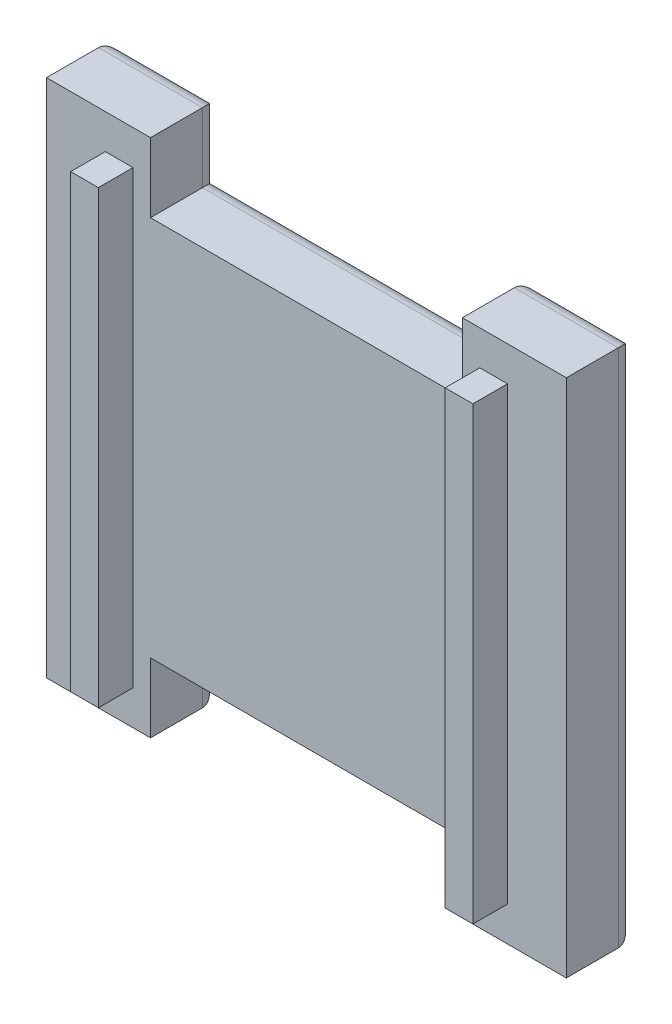
ISO-10303-21;
HEADER;
FILE_DESCRIPTION(('STEP AP214'),'2;1');
FILE_NAME('part.step','',(''),(''),'','','');
FILE_SCHEMA(('AUTOMOTIVE_DESIGN { 1 0 10303 214 1 1 1 1 }'));
ENDSEC;
DATA;
#1=APPLICATION_CONTEXT('core data for automotive mechanical design processes');
#2=APPLICATION_PROTOCOL_DEFINITION('international standard','automotive_design',2000,#1);
#3=PRODUCT_CONTEXT('',#1,'mechanical');
#4=PRODUCT('Part','Part','',(#3));
#5=PRODUCT_RELATED_PRODUCT_CATEGORY('part','',(#4));
#6=PRODUCT_DEFINITION_FORMATION('','',#4);
#7=PRODUCT_DEFINITION_CONTEXT('part definition',#1,'design');
#8=PRODUCT_DEFINITION('design','',#6,#7);
#9=PRODUCT_DEFINITION_SHAPE('','',#8);
#10=(LENGTH_UNIT() NAMED_UNIT(*) SI_UNIT(.MILLI.,.METRE.));
#11=(NAMED_UNIT(*) PLANE_ANGLE_UNIT() SI_UNIT($,.RADIAN.));
#12=(NAMED_UNIT(*) SI_UNIT($,.STERADIAN.) SOLID_ANGLE_UNIT());
#13=UNCERTAINTY_MEASURE_WITH_UNIT(LENGTH_MEASURE(1.E-05),#10,'distance_accuracy_value','');
#14=(GEOMETRIC_REPRESENTATION_CONTEXT(3) GLOBAL_UNCERTAINTY_ASSIGNED_CONTEXT((#13)) GLOBAL_UNIT_ASSIGNED_CONTEXT((#10,
#11,#12)) REPRESENTATION_CONTEXT('',''));
#15=CARTESIAN_POINT('',(0.,0.,0.));
#16=DIRECTION('',(0.,0.,1.));
#17=DIRECTION('',(1.,0.,0.));
#18=AXIS2_PLACEMENT_3D('',#15,#16,#17);
#19=CARTESIAN_POINT('',(-18.0872894333844,-25.3513782542113,5.08));
#20=DIRECTION('',(0.,1.,0.));
#21=DIRECTION('',(0.,0.,1.));
#22=AXIS2_PLACEMENT_3D('',#19,#20,#21);
#23=PLANE('',#22);
#24=DIRECTION('',(0.,0.,-1.));
#25=VECTOR('',#24,1.);
#26=CARTESIAN_POINT('',(12.3927105666156,-25.3513782542113,7.62));
#27=LINE('',#26,#25);
#28=CARTESIAN_POINT('',(12.3927105666156,-25.3513782542113,5.08));
#29=VERTEX_POINT('',#28);
#30=CARTESIAN_POINT('',(12.3927105666156,-25.3513782542113,1.27));
#31=VERTEX_POINT('',#30);
#32=EDGE_CURVE('E207',#29,#31,#27,.T.);
#33=ORIENTED_EDGE('',*,*,#32,.T.);
#34=DIRECTION('',(1.,0.,0.));
#35=VECTOR('',#34,1.);
#36=CARTESIAN_POINT('',(-18.0872894333844,-25.3513782542113,1.27));
#37=LINE('',#36,#35);
#38=CARTESIAN_POINT('',(20.0127105666156,-25.3513782542113,1.27));
#39=VERTEX_POINT('',#38);
#40=EDGE_CURVE('E44',#31,#39,#37,.T.);
#41=ORIENTED_EDGE('',*,*,#40,.T.);
#42=DIRECTION('',(0.,0.,-1.));
#43=VECTOR('',#42,1.);
#44=CARTESIAN_POINT('',(20.0127105666156,-25.3513782542113,5.08));
#45=LINE('',#44,#43);
#46=CARTESIAN_POINT('',(20.0127105666156,-25.3513782542113,5.08));
#47=VERTEX_POINT('',#46);
#48=EDGE_CURVE('E226',#47,#39,#45,.T.);
#49=ORIENTED_EDGE('',*,*,#48,.F.);
#50=DIRECTION('',(1.,0.,0.));
#51=VECTOR('',#50,1.);
#52=CARTESIAN_POINT('',(-18.0872894333844,-25.3513782542113,5.08));
#53=LINE('',#52,#51);
#54=EDGE_CURVE('E221',#29,#47,#53,.T.);
#55=ORIENTED_EDGE('',*,*,#54,.F.);
#56=EDGE_LOOP('',(#33,#41,#49,#55));
#57=FACE_BOUND('',#56,.T.);
#58=ADVANCED_FACE('F35',(#57),#23,.F.);
#59=CARTESIAN_POINT('',(-18.0872894333844,12.7486217457887,5.08));
#60=DIRECTION('',(0.,-1.,0.));
#61=DIRECTION('',(0.,0.,-1.));
#62=AXIS2_PLACEMENT_3D('',#59,#60,#61);
#63=PLANE('',#62);
#64=DIRECTION('',(0.,0.,-1.));
#65=VECTOR('',#64,1.);
#66=CARTESIAN_POINT('',(-10.4672894333844,12.7486217457887,7.62));
#67=LINE('',#66,#65);
#68=CARTESIAN_POINT('',(-10.4672894333844,12.7486217457887,5.08));
#69=VERTEX_POINT('',#68);
#70=CARTESIAN_POINT('',(-10.4672894333844,12.7486217457887,1.27));
#71=VERTEX_POINT('',#70);
#72=EDGE_CURVE('E366',#69,#71,#67,.T.);
#73=ORIENTED_EDGE('',*,*,#72,.T.);
#74=DIRECTION('',(-1.,0.,0.));
#75=VECTOR('',#74,1.);
#76=CARTESIAN_POINT('',(-18.0872894333844,12.7486217457887,1.27));
#77=LINE('',#76,#75);
#78=CARTESIAN_POINT('',(-18.0872894333844,12.7486217457887,1.27));
#79=VERTEX_POINT('',#78);
#80=EDGE_CURVE('E287',#71,#79,#77,.T.);
#81=ORIENTED_EDGE('',*,*,#80,.T.);
#82=DIRECTION('',(0.,0.,-1.));
#83=VECTOR('',#82,1.);
#84=CARTESIAN_POINT('',(-18.0872894333844,12.7486217457887,5.08));
#85=LINE('',#84,#83);
#86=CARTESIAN_POINT('',(-18.0872894333844,12.7486217457887,5.08));
#87=VERTEX_POINT('',#86);
#88=EDGE_CURVE('E243',#87,#79,#85,.T.);
#89=ORIENTED_EDGE('',*,*,#88,.F.);
#90=DIRECTION('',(-1.,0.,0.));
#91=VECTOR('',#90,1.);
#92=CARTESIAN_POINT('',(-18.0872894333844,12.7486217457887,5.08));
#93=LINE('',#92,#91);
#94=EDGE_CURVE('E239',#69,#87,#93,.T.);
#95=ORIENTED_EDGE('',*,*,#94,.F.);
#96=EDGE_LOOP('',(#73,#81,#89,#95));
#97=FACE_BOUND('',#96,.T.);
#98=ADVANCED_FACE('F476',(#97),#63,.F.);
#99=CARTESIAN_POINT('',(0.,0.,5.08));
#100=DIRECTION('',(0.,0.,1.));
#101=DIRECTION('',(1.,0.,0.));
#102=AXIS2_PLACEMENT_3D('',#99,#100,#101);
#103=PLANE('',#102);
#104=DIRECTION('',(0.,-1.,0.));
#105=VECTOR('',#104,1.);
#106=CARTESIAN_POINT('',(-10.4672894333844,0.,5.08));
#107=LINE('',#106,#105);
#108=CARTESIAN_POINT('',(-10.4672894333844,7.66862174578867,5.08));
#109=VERTEX_POINT('',#108);
#110=EDGE_CURVE('E387',#69,#109,#107,.T.);
#111=ORIENTED_EDGE('',*,*,#110,.F.);
#112=ORIENTED_EDGE('',*,*,#94,.T.);
#113=DIRECTION('',(0.,-1.,0.));
#114=VECTOR('',#113,1.);
#115=CARTESIAN_POINT('',(-18.0872894333844,12.7486217457887,5.08));
#116=LINE('',#115,#114);
#117=CARTESIAN_POINT('',(-18.0872894333844,-25.3513782542113,5.08));
#118=VERTEX_POINT('',#117);
#119=EDGE_CURVE('E229',#87,#118,#116,.T.);
#120=ORIENTED_EDGE('',*,*,#119,.T.);
#121=CARTESIAN_POINT('',(-10.4672894333844,-25.3513782542113,5.08));
#122=VERTEX_POINT('',#121);
#123=EDGE_CURVE('E228',#118,#122,#53,.T.);
#124=ORIENTED_EDGE('',*,*,#123,.T.);
#125=DIRECTION('',(0.,-1.,0.));
#126=VECTOR('',#125,1.);
#127=CARTESIAN_POINT('',(-10.4672894333844,0.,5.08));
#128=LINE('',#127,#126);
#129=CARTESIAN_POINT('',(-10.4672894333844,-20.2713782542113,5.08));
#130=VERTEX_POINT('',#129);
#131=EDGE_CURVE('E381',#130,#122,#128,.T.);
#132=ORIENTED_EDGE('',*,*,#131,.F.);
#133=DIRECTION('',(-1.,0.,0.));
#134=VECTOR('',#133,1.);
#135=CARTESIAN_POINT('',(0.,-20.2713782542113,5.08));
#136=LINE('',#135,#134);
#137=CARTESIAN_POINT('',(12.3927105666156,-20.2713782542113,5.08));
#138=VERTEX_POINT('',#137);
#139=EDGE_CURVE('E223',#138,#130,#136,.T.);
#140=ORIENTED_EDGE('',*,*,#139,.F.);
#141=DIRECTION('',(0.,1.,0.));
#142=VECTOR('',#141,1.);
#143=CARTESIAN_POINT('',(12.3927105666156,0.,5.08));
#144=LINE('',#143,#142);
#145=EDGE_CURVE('E210',#29,#138,#144,.T.);
#146=ORIENTED_EDGE('',*,*,#145,.F.);
#147=ORIENTED_EDGE('',*,*,#54,.T.);
#148=DIRECTION('',(0.,1.,0.));
#149=VECTOR('',#148,1.);
#150=CARTESIAN_POINT('',(20.0127105666156,12.7486217457887,5.08));
#151=LINE('',#150,#149);
#152=CARTESIAN_POINT('',(20.0127105666156,12.7486217457887,5.08));
#153=VERTEX_POINT('',#152);
#154=EDGE_CURVE('E232',#47,#153,#151,.T.);
#155=ORIENTED_EDGE('',*,*,#154,.T.);
#156=CARTESIAN_POINT('',(12.3927105666156,12.7486217457887,5.08));
#157=VERTEX_POINT('',#156);
#158=EDGE_CURVE('E240',#153,#157,#93,.T.);
#159=ORIENTED_EDGE('',*,*,#158,.T.);
#160=DIRECTION('',(0.,1.,0.));
#161=VECTOR('',#160,1.);
#162=CARTESIAN_POINT('',(12.3927105666156,0.,5.08));
#163=LINE('',#162,#161);
#164=CARTESIAN_POINT('',(12.3927105666156,7.66862174578867,5.08));
#165=VERTEX_POINT('',#164);
#166=EDGE_CURVE('E224',#165,#157,#163,.T.);
#167=ORIENTED_EDGE('',*,*,#166,.F.);
#168=DIRECTION('',(1.,0.,0.));
#169=VECTOR('',#168,1.);
#170=CARTESIAN_POINT('',(0.,7.66862174578867,5.08));
#171=LINE('',#170,#169);
#172=EDGE_CURVE('E385',#109,#165,#171,.T.);
#173=ORIENTED_EDGE('',*,*,#172,.F.);
#174=EDGE_LOOP('',(#111,#112,#120,#124,#132,#140,#146,#147,#155,#159,#167,#173));
#175=FACE_BOUND('',#174,.T.);
#176=DIRECTION('',(-1.,0.,0.));
#177=VECTOR('',#176,1.);
#178=CARTESIAN_POINT('',(15.7027105666156,10.2086217457887,5.08));
#179=LINE('',#178,#177);
#180=CARTESIAN_POINT('',(15.7027105666156,10.2086217457887,5.08));
#181=VERTEX_POINT('',#180);
#182=CARTESIAN_POINT('',(13.6707105666156,10.2086217457887,5.08));
#183=VERTEX_POINT('',#182);
#184=EDGE_CURVE('E432',#181,#183,#179,.T.);
#185=ORIENTED_EDGE('',*,*,#184,.F.);
#186=DIRECTION('',(0.,1.,0.));
#187=VECTOR('',#186,1.);
#188=CARTESIAN_POINT('',(15.7027105666156,-22.8113782542113,5.08));
#189=LINE('',#188,#187);
#190=CARTESIAN_POINT('',(15.7027105666156,-22.8113782542113,5.08));
#191=VERTEX_POINT('',#190);
#192=EDGE_CURVE('E418',#191,#181,#189,.T.);
#193=ORIENTED_EDGE('',*,*,#192,.F.);
#194=DIRECTION('',(1.,0.,0.));
#195=VECTOR('',#194,1.);
#196=CARTESIAN_POINT('',(15.7027105666156,-22.8113782542113,5.08));
#197=LINE('',#196,#195);
#198=CARTESIAN_POINT('',(13.6707105666156,-22.8113782542113,5.08));
#199=VERTEX_POINT('',#198);
#200=EDGE_CURVE('E423',#199,#191,#197,.T.);
#201=ORIENTED_EDGE('',*,*,#200,.F.);
#202=DIRECTION('',(0.,-1.,0.));
#203=VECTOR('',#202,1.);
#204=CARTESIAN_POINT('',(13.6707105666156,-22.8113782542113,5.08));
#205=LINE('',#204,#203);
#206=EDGE_CURVE('E434',#183,#199,#205,.T.);
#207=ORIENTED_EDGE('',*,*,#206,.F.);
#208=EDGE_LOOP('',(#185,#193,#201,#207));
#209=FACE_BOUND('',#208,.T.);
#210=DIRECTION('',(-1.,0.,0.));
#211=VECTOR('',#210,1.);
#212=CARTESIAN_POINT('',(-11.7452894173844,10.2086217457887,5.08));
#213=LINE('',#212,#211);
#214=CARTESIAN_POINT('',(-11.7452894173844,10.2086217457887,5.08));
#215=VERTEX_POINT('',#214);
#216=CARTESIAN_POINT('',(-13.7772894173844,10.2086217457887,5.08));
#217=VERTEX_POINT('',#216);
#218=EDGE_CURVE('E403',#215,#217,#213,.T.);
#219=ORIENTED_EDGE('',*,*,#218,.F.);
#220=DIRECTION('',(0.,1.,0.));
#221=VECTOR('',#220,1.);
#222=CARTESIAN_POINT('',(-11.7452894173844,-22.8113782542113,5.08));
#223=LINE('',#222,#221);
#224=CARTESIAN_POINT('',(-11.7452894173844,-22.8113782542113,5.08));
#225=VERTEX_POINT('',#224);
#226=EDGE_CURVE('E389',#225,#215,#223,.T.);
#227=ORIENTED_EDGE('',*,*,#226,.F.);
#228=DIRECTION('',(1.,0.,0.));
#229=VECTOR('',#228,1.);
#230=CARTESIAN_POINT('',(-11.7452894173844,-22.8113782542113,5.08));
#231=LINE('',#230,#229);
#232=CARTESIAN_POINT('',(-13.7772894173844,-22.8113782542113,5.08));
#233=VERTEX_POINT('',#232);
#234=EDGE_CURVE('E394',#233,#225,#231,.T.);
#235=ORIENTED_EDGE('',*,*,#234,.F.);
#236=DIRECTION('',(0.,-1.,0.));
#237=VECTOR('',#236,1.);
#238=CARTESIAN_POINT('',(-13.7772894173844,-22.8113782542113,5.08));
#239=LINE('',#238,#237);
#240=EDGE_CURVE('E405',#217,#233,#239,.T.);
#241=ORIENTED_EDGE('',*,*,#240,.F.);
#242=EDGE_LOOP('',(#219,#227,#235,#241));
#243=FACE_BOUND('',#242,.T.);
#244=ADVANCED_FACE('F219',(#175,#209,#243),#103,.T.);
#245=CARTESIAN_POINT('',(-18.0872894333844,12.7486217457887,5.08));
#246=DIRECTION('',(1.,0.,0.));
#247=DIRECTION('',(0.,1.,0.));
#248=AXIS2_PLACEMENT_3D('',#245,#246,#247);
#249=PLANE('',#248);
#250=ORIENTED_EDGE('',*,*,#88,.T.);
#251=DIRECTION('',(0.,-1.,0.));
#252=VECTOR('',#251,1.);
#253=CARTESIAN_POINT('',(-18.0872894333844,12.7486217457887,1.27));
#254=LINE('',#253,#252);
#255=CARTESIAN_POINT('',(-18.0872894333844,-25.3513782542113,1.27));
#256=VERTEX_POINT('',#255);
#257=EDGE_CURVE('E289',#79,#256,#254,.T.);
#258=ORIENTED_EDGE('',*,*,#257,.T.);
#259=DIRECTION('',(0.,0.,-1.));
#260=VECTOR('',#259,1.);
#261=CARTESIAN_POINT('',(-18.0872894333844,-25.3513782542113,5.08));
#262=LINE('',#261,#260);
#263=EDGE_CURVE('E250',#118,#256,#262,.T.);
#264=ORIENTED_EDGE('',*,*,#263,.F.);
#265=ORIENTED_EDGE('',*,*,#119,.F.);
#266=EDGE_LOOP('',(#250,#258,#264,#265));
#267=FACE_BOUND('',#266,.T.);
#268=ADVANCED_FACE('F488',(#267),#249,.F.);
#269=ORIENTED_EDGE('',*,*,#263,.T.);
#270=DIRECTION('',(1.,0.,0.));
#271=VECTOR('',#270,1.);
#272=CARTESIAN_POINT('',(-18.0872894333844,-25.3513782542113,1.27));
#273=LINE('',#272,#271);
#274=CARTESIAN_POINT('',(-10.4672894333844,-25.3513782542113,1.27));
#275=VERTEX_POINT('',#274);
#276=EDGE_CURVE('E291',#256,#275,#273,.T.);
#277=ORIENTED_EDGE('',*,*,#276,.T.);
#278=DIRECTION('',(0.,0.,-1.));
#279=VECTOR('',#278,1.);
#280=CARTESIAN_POINT('',(-10.4672894333844,-25.3513782542113,7.62));
#281=LINE('',#280,#279);
#282=EDGE_CURVE('E214',#122,#275,#281,.T.);
#283=ORIENTED_EDGE('',*,*,#282,.F.);
#284=ORIENTED_EDGE('',*,*,#123,.F.);
#285=EDGE_LOOP('',(#269,#277,#283,#284));
#286=FACE_BOUND('',#285,.T.);
#287=ADVANCED_FACE('F478',(#286),#23,.F.);
#288=CARTESIAN_POINT('',(20.0127105666156,12.7486217457887,5.08));
#289=DIRECTION('',(-1.,0.,0.));
#290=DIRECTION('',(0.,-1.,0.));
#291=AXIS2_PLACEMENT_3D('',#288,#289,#290);
#292=PLANE('',#291);
#293=ORIENTED_EDGE('',*,*,#48,.T.);
#294=DIRECTION('',(0.,1.,0.));
#295=VECTOR('',#294,1.);
#296=CARTESIAN_POINT('',(20.0127105666156,12.7486217457887,1.27));
#297=LINE('',#296,#295);
#298=CARTESIAN_POINT('',(20.0127105666156,12.7486217457887,1.27));
#299=VERTEX_POINT('',#298);
#300=EDGE_CURVE('E11',#39,#299,#297,.T.);
#301=ORIENTED_EDGE('',*,*,#300,.T.);
#302=DIRECTION('',(0.,0.,-1.));
#303=VECTOR('',#302,1.);
#304=CARTESIAN_POINT('',(20.0127105666156,12.7486217457887,5.08));
#305=LINE('',#304,#303);
#306=EDGE_CURVE('E246',#153,#299,#305,.T.);
#307=ORIENTED_EDGE('',*,*,#306,.F.);
#308=ORIENTED_EDGE('',*,*,#154,.F.);
#309=EDGE_LOOP('',(#293,#301,#307,#308));
#310=FACE_BOUND('',#309,.T.);
#311=ADVANCED_FACE('F487',(#310),#292,.F.);
#312=ORIENTED_EDGE('',*,*,#306,.T.);
#313=DIRECTION('',(-1.,0.,0.));
#314=VECTOR('',#313,1.);
#315=CARTESIAN_POINT('',(-18.0872894333844,12.7486217457887,1.27));
#316=LINE('',#315,#314);
#317=CARTESIAN_POINT('',(12.3927105666156,12.7486217457887,1.27));
#318=VERTEX_POINT('',#317);
#319=EDGE_CURVE('E285',#299,#318,#316,.T.);
#320=ORIENTED_EDGE('',*,*,#319,.T.);
#321=DIRECTION('',(0.,0.,-1.));
#322=VECTOR('',#321,1.);
#323=CARTESIAN_POINT('',(12.3927105666156,12.7486217457887,7.62));
#324=LINE('',#323,#322);
#325=EDGE_CURVE('E358',#157,#318,#324,.T.);
#326=ORIENTED_EDGE('',*,*,#325,.F.);
#327=ORIENTED_EDGE('',*,*,#158,.F.);
#328=EDGE_LOOP('',(#312,#320,#326,#327));
#329=FACE_BOUND('',#328,.T.);
#330=ADVANCED_FACE('F356',(#329),#63,.F.);
#331=CARTESIAN_POINT('',(0.,0.,0.));
#332=DIRECTION('',(0.,0.,1.));
#333=DIRECTION('',(1.,0.,0.));
#334=AXIS2_PLACEMENT_3D('',#331,#332,#333);
#335=PLANE('',#334);
#336=DIRECTION('',(0.,-1.,0.));
#337=VECTOR('',#336,1.);
#338=CARTESIAN_POINT('',(-16.8172894333844,0.,0.));
#339=LINE('',#338,#337);
#340=CARTESIAN_POINT('',(-16.8172894333844,-24.0813782542113,0.));
#341=VERTEX_POINT('',#340);
#342=CARTESIAN_POINT('',(-16.8172894333844,11.4786217457887,0.));
#343=VERTEX_POINT('',#342);
#344=EDGE_CURVE('E277',#341,#343,#339,.F.);
#345=ORIENTED_EDGE('',*,*,#344,.T.);
#346=DIRECTION('',(-1.,0.,0.));
#347=VECTOR('',#346,1.);
#348=CARTESIAN_POINT('',(0.,11.4786217457887,0.));
#349=LINE('',#348,#347);
#350=CARTESIAN_POINT('',(-11.7372894333844,11.4786217457887,0.));
#351=VERTEX_POINT('',#350);
#352=EDGE_CURVE('E279',#343,#351,#349,.F.);
#353=ORIENTED_EDGE('',*,*,#352,.T.);
#354=DIRECTION('',(0.,1.,0.));
#355=VECTOR('',#354,1.);
#356=CARTESIAN_POINT('',(-11.7372894333844,0.,0.));
#357=LINE('',#356,#355);
#358=CARTESIAN_POINT('',(-11.7372894333844,6.39862174578867,0.));
#359=VERTEX_POINT('',#358);
#360=EDGE_CURVE('E268',#351,#359,#357,.F.);
#361=ORIENTED_EDGE('',*,*,#360,.T.);
#362=DIRECTION('',(-1.,0.,0.));
#363=VECTOR('',#362,1.);
#364=CARTESIAN_POINT('',(0.,6.39862174578867,0.));
#365=LINE('',#364,#363);
#366=CARTESIAN_POINT('',(13.6627105666156,6.39862174578866,0.));
#367=VERTEX_POINT('',#366);
#368=EDGE_CURVE('E266',#359,#367,#365,.F.);
#369=ORIENTED_EDGE('',*,*,#368,.T.);
#370=DIRECTION('',(0.,-1.,0.));
#371=VECTOR('',#370,1.);
#372=CARTESIAN_POINT('',(13.6627105666156,0.,0.));
#373=LINE('',#372,#371);
#374=CARTESIAN_POINT('',(13.6627105666156,11.4786217457887,0.));
#375=VERTEX_POINT('',#374);
#376=EDGE_CURVE('E264',#367,#375,#373,.F.);
#377=ORIENTED_EDGE('',*,*,#376,.T.);
#378=DIRECTION('',(-1.,0.,0.));
#379=VECTOR('',#378,1.);
#380=CARTESIAN_POINT('',(0.,11.4786217457887,0.));
#381=LINE('',#380,#379);
#382=CARTESIAN_POINT('',(18.7427105666156,11.4786217457887,0.));
#383=VERTEX_POINT('',#382);
#384=EDGE_CURVE('E262',#375,#383,#381,.F.);
#385=ORIENTED_EDGE('',*,*,#384,.T.);
#386=DIRECTION('',(0.,1.,0.));
#387=VECTOR('',#386,1.);
#388=CARTESIAN_POINT('',(18.7427105666156,0.,0.));
#389=LINE('',#388,#387);
#390=CARTESIAN_POINT('',(18.7427105666156,-24.0813782542113,0.));
#391=VERTEX_POINT('',#390);
#392=EDGE_CURVE('E256',#383,#391,#389,.F.);
#393=ORIENTED_EDGE('',*,*,#392,.T.);
#394=DIRECTION('',(1.,0.,0.));
#395=VECTOR('',#394,1.);
#396=CARTESIAN_POINT('',(0.,-24.0813782542113,0.));
#397=LINE('',#396,#395);
#398=CARTESIAN_POINT('',(13.6627105666156,-24.0813782542113,0.));
#399=VERTEX_POINT('',#398);
#400=EDGE_CURVE('E258',#391,#399,#397,.F.);
#401=ORIENTED_EDGE('',*,*,#400,.T.);
#402=DIRECTION('',(0.,-1.,0.));
#403=VECTOR('',#402,1.);
#404=CARTESIAN_POINT('',(13.6627105666156,0.,0.));
#405=LINE('',#404,#403);
#406=CARTESIAN_POINT('',(13.6627105666156,-19.0013782542113,0.));
#407=VERTEX_POINT('',#406);
#408=EDGE_CURVE('E260',#399,#407,#405,.F.);
#409=ORIENTED_EDGE('',*,*,#408,.T.);
#410=DIRECTION('',(1.,0.,0.));
#411=VECTOR('',#410,1.);
#412=CARTESIAN_POINT('',(0.,-19.0013782542113,0.));
#413=LINE('',#412,#411);
#414=CARTESIAN_POINT('',(-11.7372894333844,-19.0013782542113,0.));
#415=VERTEX_POINT('',#414);
#416=EDGE_CURVE('E271',#407,#415,#413,.F.);
#417=ORIENTED_EDGE('',*,*,#416,.T.);
#418=DIRECTION('',(0.,1.,0.));
#419=VECTOR('',#418,1.);
#420=CARTESIAN_POINT('',(-11.7372894333844,0.,0.));
#421=LINE('',#420,#419);
#422=CARTESIAN_POINT('',(-11.7372894333844,-24.0813782542113,0.));
#423=VERTEX_POINT('',#422);
#424=EDGE_CURVE('E273',#415,#423,#421,.F.);
#425=ORIENTED_EDGE('',*,*,#424,.T.);
#426=DIRECTION('',(1.,0.,0.));
#427=VECTOR('',#426,1.);
#428=CARTESIAN_POINT('',(0.,-24.0813782542113,0.));
#429=LINE('',#428,#427);
#430=EDGE_CURVE('E275',#423,#341,#429,.F.);
#431=ORIENTED_EDGE('',*,*,#430,.T.);
#432=EDGE_LOOP('',(#345,#353,#361,#369,#377,#385,#393,#401,#409,#417,#425,#431));
#433=FACE_BOUND('',#432,.T.);
#434=ADVANCED_FACE('F340',(#433),#335,.F.);
#435=CARTESIAN_POINT('',(15.7027105666156,-22.8113782542113,7.62));
#436=DIRECTION('',(-1.,0.,0.));
#437=DIRECTION('',(0.,0.,1.));
#438=AXIS2_PLACEMENT_3D('',#435,#436,#437);
#439=PLANE('',#438);
#440=ORIENTED_EDGE('',*,*,#192,.T.);
#441=DIRECTION('',(0.,0.,-1.));
#442=VECTOR('',#441,1.);
#443=CARTESIAN_POINT('',(15.7027105666156,10.2086217457887,7.62));
#444=LINE('',#443,#442);
#445=CARTESIAN_POINT('',(15.7027105666156,10.2086217457887,7.62));
#446=VERTEX_POINT('',#445);
#447=EDGE_CURVE('E234',#446,#181,#444,.T.);
#448=ORIENTED_EDGE('',*,*,#447,.F.);
#449=DIRECTION('',(0.,1.,0.));
#450=VECTOR('',#449,1.);
#451=CARTESIAN_POINT('',(15.7027105666156,-22.8113782542113,7.62));
#452=LINE('',#451,#450);
#453=CARTESIAN_POINT('',(15.7027105666156,-22.8113782542113,7.62));
#454=VERTEX_POINT('',#453);
#455=EDGE_CURVE('E419',#454,#446,#452,.T.);
#456=ORIENTED_EDGE('',*,*,#455,.F.);
#457=DIRECTION('',(0.,0.,-1.));
#458=VECTOR('',#457,1.);
#459=CARTESIAN_POINT('',(15.7027105666156,-22.8113782542113,7.62));
#460=LINE('',#459,#458);
#461=EDGE_CURVE('E429',#454,#191,#460,.T.);
#462=ORIENTED_EDGE('',*,*,#461,.T.);
#463=EDGE_LOOP('',(#440,#448,#456,#462));
#464=FACE_BOUND('',#463,.T.);
#465=ADVANCED_FACE('F452',(#464),#439,.F.);
#466=CARTESIAN_POINT('',(15.7027105666156,10.2086217457887,7.62));
#467=DIRECTION('',(0.,-1.,0.));
#468=DIRECTION('',(0.,0.,-1.));
#469=AXIS2_PLACEMENT_3D('',#466,#467,#468);
#470=PLANE('',#469);
#471=ORIENTED_EDGE('',*,*,#184,.T.);
#472=DIRECTION('',(0.,0.,-1.));
#473=VECTOR('',#472,1.);
#474=CARTESIAN_POINT('',(13.6707105666156,10.2086217457887,7.62));
#475=LINE('',#474,#473);
#476=CARTESIAN_POINT('',(13.6707105666156,10.2086217457887,7.62));
#477=VERTEX_POINT('',#476);
#478=EDGE_CURVE('E442',#477,#183,#475,.T.);
#479=ORIENTED_EDGE('',*,*,#478,.F.);
#480=DIRECTION('',(-1.,0.,0.));
#481=VECTOR('',#480,1.);
#482=CARTESIAN_POINT('',(15.7027105666156,10.2086217457887,7.62));
#483=LINE('',#482,#481);
#484=EDGE_CURVE('E422',#446,#477,#483,.T.);
#485=ORIENTED_EDGE('',*,*,#484,.F.);
#486=ORIENTED_EDGE('',*,*,#447,.T.);
#487=EDGE_LOOP('',(#471,#479,#485,#486));
#488=FACE_BOUND('',#487,.T.);
#489=ADVANCED_FACE('F446',(#488),#470,.F.);
#490=CARTESIAN_POINT('',(13.6707105666156,-22.8113782542113,7.62));
#491=DIRECTION('',(1.,0.,0.));
#492=DIRECTION('',(0.,0.,-1.));
#493=AXIS2_PLACEMENT_3D('',#490,#491,#492);
#494=PLANE('',#493);
#495=ORIENTED_EDGE('',*,*,#206,.T.);
#496=DIRECTION('',(0.,0.,-1.));
#497=VECTOR('',#496,1.);
#498=CARTESIAN_POINT('',(13.6707105666156,-22.8113782542113,7.62));
#499=LINE('',#498,#497);
#500=CARTESIAN_POINT('',(13.6707105666156,-22.8113782542113,7.62));
#501=VERTEX_POINT('',#500);
#502=EDGE_CURVE('E440',#501,#199,#499,.T.);
#503=ORIENTED_EDGE('',*,*,#502,.F.);
#504=DIRECTION('',(0.,-1.,0.));
#505=VECTOR('',#504,1.);
#506=CARTESIAN_POINT('',(13.6707105666156,-22.8113782542113,7.62));
#507=LINE('',#506,#505);
#508=EDGE_CURVE('E425',#477,#501,#507,.T.);
#509=ORIENTED_EDGE('',*,*,#508,.F.);
#510=ORIENTED_EDGE('',*,*,#478,.T.);
#511=EDGE_LOOP('',(#495,#503,#509,#510));
#512=FACE_BOUND('',#511,.T.);
#513=ADVANCED_FACE('F459',(#512),#494,.F.);
#514=CARTESIAN_POINT('',(15.7027105666156,-22.8113782542113,7.62));
#515=DIRECTION('',(0.,1.,0.));
#516=DIRECTION('',(0.,0.,1.));
#517=AXIS2_PLACEMENT_3D('',#514,#515,#516);
#518=PLANE('',#517);
#519=ORIENTED_EDGE('',*,*,#200,.T.);
#520=ORIENTED_EDGE('',*,*,#461,.F.);
#521=DIRECTION('',(1.,0.,0.));
#522=VECTOR('',#521,1.);
#523=CARTESIAN_POINT('',(15.7027105666156,-22.8113782542113,7.62));
#524=LINE('',#523,#522);
#525=EDGE_CURVE('E427',#501,#454,#524,.T.);
#526=ORIENTED_EDGE('',*,*,#525,.F.);
#527=ORIENTED_EDGE('',*,*,#502,.T.);
#528=EDGE_LOOP('',(#519,#520,#526,#527));
#529=FACE_BOUND('',#528,.T.);
#530=ADVANCED_FACE('F465',(#529),#518,.F.);
#531=CARTESIAN_POINT('',(0.,0.,7.62));
#532=DIRECTION('',(0.,0.,1.));
#533=DIRECTION('',(1.,0.,0.));
#534=AXIS2_PLACEMENT_3D('',#531,#532,#533);
#535=PLANE('',#534);
#536=ORIENTED_EDGE('',*,*,#455,.T.);
#537=ORIENTED_EDGE('',*,*,#484,.T.);
#538=ORIENTED_EDGE('',*,*,#508,.T.);
#539=ORIENTED_EDGE('',*,*,#525,.T.);
#540=EDGE_LOOP('',(#536,#537,#538,#539));
#541=FACE_BOUND('',#540,.T.);
#542=ADVANCED_FACE('F463',(#541),#535,.T.);
#543=CARTESIAN_POINT('',(-11.7452894173844,-22.8113782542113,7.62));
#544=DIRECTION('',(-1.,0.,0.));
#545=DIRECTION('',(0.,-1.,0.));
#546=AXIS2_PLACEMENT_3D('',#543,#544,#545);
#547=PLANE('',#546);
#548=ORIENTED_EDGE('',*,*,#226,.T.);
#549=DIRECTION('',(0.,0.,-1.));
#550=VECTOR('',#549,1.);
#551=CARTESIAN_POINT('',(-11.7452894173844,10.2086217457887,7.62));
#552=LINE('',#551,#550);
#553=CARTESIAN_POINT('',(-11.7452894173844,10.2086217457887,7.62));
#554=VERTEX_POINT('',#553);
#555=EDGE_CURVE('E416',#554,#215,#552,.T.);
#556=ORIENTED_EDGE('',*,*,#555,.F.);
#557=DIRECTION('',(0.,1.,0.));
#558=VECTOR('',#557,1.);
#559=CARTESIAN_POINT('',(-11.7452894173844,-22.8113782542113,7.62));
#560=LINE('',#559,#558);
#561=CARTESIAN_POINT('',(-11.7452894173844,-22.8113782542113,7.62));
#562=VERTEX_POINT('',#561);
#563=EDGE_CURVE('E390',#562,#554,#560,.T.);
#564=ORIENTED_EDGE('',*,*,#563,.F.);
#565=DIRECTION('',(0.,0.,-1.));
#566=VECTOR('',#565,1.);
#567=CARTESIAN_POINT('',(-11.7452894173844,-22.8113782542113,7.62));
#568=LINE('',#567,#566);
#569=EDGE_CURVE('E400',#562,#225,#568,.T.);
#570=ORIENTED_EDGE('',*,*,#569,.T.);
#571=EDGE_LOOP('',(#548,#556,#564,#570));
#572=FACE_BOUND('',#571,.T.);
#573=ADVANCED_FACE('F472',(#572),#547,.F.);
#574=CARTESIAN_POINT('',(-11.7452894173844,10.2086217457887,7.62));
#575=DIRECTION('',(0.,-1.,0.));
#576=DIRECTION('',(0.,0.,-1.));
#577=AXIS2_PLACEMENT_3D('',#574,#575,#576);
#578=PLANE('',#577);
#579=ORIENTED_EDGE('',*,*,#218,.T.);
#580=DIRECTION('',(0.,0.,-1.));
#581=VECTOR('',#580,1.);
#582=CARTESIAN_POINT('',(-13.7772894173844,10.2086217457887,7.62));
#583=LINE('',#582,#581);
#584=CARTESIAN_POINT('',(-13.7772894173844,10.2086217457887,7.62));
#585=VERTEX_POINT('',#584);
#586=EDGE_CURVE('E413',#585,#217,#583,.T.);
#587=ORIENTED_EDGE('',*,*,#586,.F.);
#588=DIRECTION('',(-1.,0.,0.));
#589=VECTOR('',#588,1.);
#590=CARTESIAN_POINT('',(-11.7452894173844,10.2086217457887,7.62));
#591=LINE('',#590,#589);
#592=EDGE_CURVE('E393',#554,#585,#591,.T.);
#593=ORIENTED_EDGE('',*,*,#592,.F.);
#594=ORIENTED_EDGE('',*,*,#555,.T.);
#595=EDGE_LOOP('',(#579,#587,#593,#594));
#596=FACE_BOUND('',#595,.T.);
#597=ADVANCED_FACE('F597',(#596),#578,.F.);
#598=CARTESIAN_POINT('',(-13.7772894173844,-22.8113782542113,7.62));
#599=DIRECTION('',(1.,0.,0.));
#600=DIRECTION('',(0.,0.,-1.));
#601=AXIS2_PLACEMENT_3D('',#598,#599,#600);
#602=PLANE('',#601);
#603=ORIENTED_EDGE('',*,*,#240,.T.);
#604=DIRECTION('',(0.,0.,-1.));
#605=VECTOR('',#604,1.);
#606=CARTESIAN_POINT('',(-13.7772894173844,-22.8113782542113,7.62));
#607=LINE('',#606,#605);
#608=CARTESIAN_POINT('',(-13.7772894173844,-22.8113782542113,7.62));
#609=VERTEX_POINT('',#608);
#610=EDGE_CURVE('E411',#609,#233,#607,.T.);
#611=ORIENTED_EDGE('',*,*,#610,.F.);
#612=DIRECTION('',(0.,-1.,0.));
#613=VECTOR('',#612,1.);
#614=CARTESIAN_POINT('',(-13.7772894173844,-22.8113782542113,7.62));
#615=LINE('',#614,#613);
#616=EDGE_CURVE('E396',#585,#609,#615,.T.);
#617=ORIENTED_EDGE('',*,*,#616,.F.);
#618=ORIENTED_EDGE('',*,*,#586,.T.);
#619=EDGE_LOOP('',(#603,#611,#617,#618));
#620=FACE_BOUND('',#619,.T.);
#621=ADVANCED_FACE('F593',(#620),#602,.F.);
#622=CARTESIAN_POINT('',(-11.7452894173844,-22.8113782542113,7.62));
#623=DIRECTION('',(0.,1.,0.));
#624=DIRECTION('',(0.,0.,1.));
#625=AXIS2_PLACEMENT_3D('',#622,#623,#624);
#626=PLANE('',#625);
#627=ORIENTED_EDGE('',*,*,#234,.T.);
#628=ORIENTED_EDGE('',*,*,#569,.F.);
#629=DIRECTION('',(1.,0.,0.));
#630=VECTOR('',#629,1.);
#631=CARTESIAN_POINT('',(-11.7452894173844,-22.8113782542113,7.62));
#632=LINE('',#631,#630);
#633=EDGE_CURVE('E398',#609,#562,#632,.T.);
#634=ORIENTED_EDGE('',*,*,#633,.F.);
#635=ORIENTED_EDGE('',*,*,#610,.T.);
#636=EDGE_LOOP('',(#627,#628,#634,#635));
#637=FACE_BOUND('',#636,.T.);
#638=ADVANCED_FACE('F589',(#637),#626,.F.);
#639=CARTESIAN_POINT('',(0.,0.,7.62));
#640=DIRECTION('',(0.,0.,1.));
#641=DIRECTION('',(1.,0.,0.));
#642=AXIS2_PLACEMENT_3D('',#639,#640,#641);
#643=PLANE('',#642);
#644=ORIENTED_EDGE('',*,*,#563,.T.);
#645=ORIENTED_EDGE('',*,*,#592,.T.);
#646=ORIENTED_EDGE('',*,*,#616,.T.);
#647=ORIENTED_EDGE('',*,*,#633,.T.);
#648=EDGE_LOOP('',(#644,#645,#646,#647));
#649=FACE_BOUND('',#648,.T.);
#650=ADVANCED_FACE('F586',(#649),#643,.T.);
#651=CARTESIAN_POINT('',(12.3927105666156,-25.3513782542113,7.62));
#652=DIRECTION('',(1.,0.,0.));
#653=DIRECTION('',(0.,0.,-1.));
#654=AXIS2_PLACEMENT_3D('',#651,#652,#653);
#655=PLANE('',#654);
#656=DIRECTION('',(0.,0.,-1.));
#657=VECTOR('',#656,1.);
#658=CARTESIAN_POINT('',(12.3927105666156,-20.2713782542113,7.62));
#659=LINE('',#658,#657);
#660=CARTESIAN_POINT('',(12.3927105666156,-20.2713782542113,1.27));
#661=VERTEX_POINT('',#660);
#662=EDGE_CURVE('E371',#138,#661,#659,.T.);
#663=ORIENTED_EDGE('',*,*,#662,.T.);
#664=DIRECTION('',(0.,-1.,0.));
#665=VECTOR('',#664,1.);
#666=CARTESIAN_POINT('',(12.3927105666156,-25.3513782542113,1.27));
#667=LINE('',#666,#665);
#668=EDGE_CURVE('E59',#661,#31,#667,.T.);
#669=ORIENTED_EDGE('',*,*,#668,.T.);
#670=ORIENTED_EDGE('',*,*,#32,.F.);
#671=ORIENTED_EDGE('',*,*,#145,.T.);
#672=EDGE_LOOP('',(#663,#669,#670,#671));
#673=FACE_BOUND('',#672,.T.);
#674=ADVANCED_FACE('F209',(#673),#655,.F.);
#675=CARTESIAN_POINT('',(12.3927105666156,-20.2713782542113,7.62));
#676=DIRECTION('',(0.,1.,0.));
#677=DIRECTION('',(0.,0.,1.));
#678=AXIS2_PLACEMENT_3D('',#675,#676,#677);
#679=PLANE('',#678);
#680=DIRECTION('',(0.,0.,-1.));
#681=VECTOR('',#680,1.);
#682=CARTESIAN_POINT('',(-10.4672894333844,-20.2713782542113,7.62));
#683=LINE('',#682,#681);
#684=CARTESIAN_POINT('',(-10.4672894333844,-20.2713782542113,1.27));
#685=VERTEX_POINT('',#684);
#686=EDGE_CURVE('E376',#130,#685,#683,.T.);
#687=ORIENTED_EDGE('',*,*,#686,.T.);
#688=DIRECTION('',(1.,0.,0.));
#689=VECTOR('',#688,1.);
#690=CARTESIAN_POINT('',(12.3927105666156,-20.2713782542113,1.27));
#691=LINE('',#690,#689);
#692=EDGE_CURVE('E296',#685,#661,#691,.T.);
#693=ORIENTED_EDGE('',*,*,#692,.T.);
#694=ORIENTED_EDGE('',*,*,#662,.F.);
#695=ORIENTED_EDGE('',*,*,#139,.T.);
#696=EDGE_LOOP('',(#687,#693,#694,#695));
#697=FACE_BOUND('',#696,.T.);
#698=ADVANCED_FACE('F520',(#697),#679,.F.);
#699=CARTESIAN_POINT('',(-10.4672894333844,-25.3513782542113,7.62));
#700=DIRECTION('',(-1.,0.,0.));
#701=DIRECTION('',(0.,0.,1.));
#702=AXIS2_PLACEMENT_3D('',#699,#700,#701);
#703=PLANE('',#702);
#704=ORIENTED_EDGE('',*,*,#282,.T.);
#705=DIRECTION('',(0.,1.,0.));
#706=VECTOR('',#705,1.);
#707=CARTESIAN_POINT('',(-10.4672894333844,-25.3513782542113,1.27));
#708=LINE('',#707,#706);
#709=EDGE_CURVE('E293',#275,#685,#708,.T.);
#710=ORIENTED_EDGE('',*,*,#709,.T.);
#711=ORIENTED_EDGE('',*,*,#686,.F.);
#712=ORIENTED_EDGE('',*,*,#131,.T.);
#713=EDGE_LOOP('',(#704,#710,#711,#712));
#714=FACE_BOUND('',#713,.T.);
#715=ADVANCED_FACE('F518',(#714),#703,.F.);
#716=CARTESIAN_POINT('',(-10.4672894333844,12.7486217457887,7.62));
#717=DIRECTION('',(-1.,0.,0.));
#718=DIRECTION('',(0.,-1.,0.));
#719=AXIS2_PLACEMENT_3D('',#716,#717,#718);
#720=PLANE('',#719);
#721=DIRECTION('',(0.,0.,-1.));
#722=VECTOR('',#721,1.);
#723=CARTESIAN_POINT('',(-10.4672894333844,7.66862174578867,7.62));
#724=LINE('',#723,#722);
#725=CARTESIAN_POINT('',(-10.4672894333844,7.66862174578867,1.27));
#726=VERTEX_POINT('',#725);
#727=EDGE_CURVE('E368',#109,#726,#724,.T.);
#728=ORIENTED_EDGE('',*,*,#727,.T.);
#729=DIRECTION('',(0.,1.,0.));
#730=VECTOR('',#729,1.);
#731=CARTESIAN_POINT('',(-10.4672894333844,12.7486217457887,1.27));
#732=LINE('',#731,#730);
#733=EDGE_CURVE('E253',#726,#71,#732,.T.);
#734=ORIENTED_EDGE('',*,*,#733,.T.);
#735=ORIENTED_EDGE('',*,*,#72,.F.);
#736=ORIENTED_EDGE('',*,*,#110,.T.);
#737=EDGE_LOOP('',(#728,#734,#735,#736));
#738=FACE_BOUND('',#737,.T.);
#739=ADVANCED_FACE('F568',(#738),#720,.F.);
#740=CARTESIAN_POINT('',(-10.4672894333844,7.66862174578867,7.62));
#741=DIRECTION('',(0.,-1.,0.));
#742=DIRECTION('',(1.,0.,0.));
#743=AXIS2_PLACEMENT_3D('',#740,#741,#742);
#744=PLANE('',#743);
#745=DIRECTION('',(0.,0.,-1.));
#746=VECTOR('',#745,1.);
#747=CARTESIAN_POINT('',(12.3927105666156,7.66862174578867,7.62));
#748=LINE('',#747,#746);
#749=CARTESIAN_POINT('',(12.3927105666156,7.66862174578867,1.27));
#750=VERTEX_POINT('',#749);
#751=EDGE_CURVE('E365',#165,#750,#748,.T.);
#752=ORIENTED_EDGE('',*,*,#751,.T.);
#753=DIRECTION('',(-1.,0.,0.));
#754=VECTOR('',#753,1.);
#755=CARTESIAN_POINT('',(-10.4672894333844,7.66862174578867,1.27));
#756=LINE('',#755,#754);
#757=EDGE_CURVE('E281',#750,#726,#756,.T.);
#758=ORIENTED_EDGE('',*,*,#757,.T.);
#759=ORIENTED_EDGE('',*,*,#727,.F.);
#760=ORIENTED_EDGE('',*,*,#172,.T.);
#761=EDGE_LOOP('',(#752,#758,#759,#760));
#762=FACE_BOUND('',#761,.T.);
#763=ADVANCED_FACE('F565',(#762),#744,.F.);
#764=CARTESIAN_POINT('',(12.3927105666156,12.7486217457887,7.62));
#765=DIRECTION('',(1.,0.,0.));
#766=DIRECTION('',(0.,0.,-1.));
#767=AXIS2_PLACEMENT_3D('',#764,#765,#766);
#768=PLANE('',#767);
#769=ORIENTED_EDGE('',*,*,#325,.T.);
#770=DIRECTION('',(0.,-1.,0.));
#771=VECTOR('',#770,1.);
#772=CARTESIAN_POINT('',(12.3927105666156,12.7486217457887,1.27));
#773=LINE('',#772,#771);
#774=EDGE_CURVE('E283',#318,#750,#773,.T.);
#775=ORIENTED_EDGE('',*,*,#774,.T.);
#776=ORIENTED_EDGE('',*,*,#751,.F.);
#777=ORIENTED_EDGE('',*,*,#166,.T.);
#778=EDGE_LOOP('',(#769,#775,#776,#777));
#779=FACE_BOUND('',#778,.T.);
#780=ADVANCED_FACE('F361',(#779),#768,.F.);
#781=CARTESIAN_POINT('',(13.6627105666156,-25.3513782542113,1.27));
#782=DIRECTION('',(0.,-1.,0.));
#783=DIRECTION('',(0.,0.,-1.));
#784=AXIS2_PLACEMENT_3D('',#781,#782,#783);
#785=CYLINDRICAL_SURFACE('',#784,1.27);
#786=CARTESIAN_POINT('',(13.6627105666156,-19.0013782542113,1.27));
#787=DIRECTION('',(0.707106781186547,-0.707106781186547,0.));
#788=DIRECTION('',(-0.707106781186547,-0.707106781186547,0.));
#789=AXIS2_PLACEMENT_3D('',#786,#787,#788);
#790=ELLIPSE('',#789,1.79605122421383,1.27);
#791=EDGE_CURVE('E326',#407,#661,#790,.F.);
#792=ORIENTED_EDGE('',*,*,#791,.F.);
#793=ORIENTED_EDGE('',*,*,#408,.F.);
#794=CARTESIAN_POINT('',(13.6627105666156,-24.0813782542113,1.27));
#795=DIRECTION('',(0.707106781186547,-0.707106781186547,0.));
#796=DIRECTION('',(0.707106781186547,0.707106781186547,0.));
#797=AXIS2_PLACEMENT_3D('',#794,#795,#796);
#798=ELLIPSE('',#797,1.79605122421383,1.27);
#799=EDGE_CURVE('E39',#31,#399,#798,.T.);
#800=ORIENTED_EDGE('',*,*,#799,.F.);
#801=ORIENTED_EDGE('',*,*,#668,.F.);
#802=EDGE_LOOP('',(#792,#793,#800,#801));
#803=FACE_BOUND('',#802,.T.);
#804=ADVANCED_FACE('F37',(#803),#785,.T.);
#805=CARTESIAN_POINT('',(-18.0872894333844,-24.0813782542113,1.27));
#806=DIRECTION('',(1.,0.,0.));
#807=DIRECTION('',(0.,0.,-1.));
#808=AXIS2_PLACEMENT_3D('',#805,#806,#807);
#809=CYLINDRICAL_SURFACE('',#808,1.27);
#810=ORIENTED_EDGE('',*,*,#799,.T.);
#811=ORIENTED_EDGE('',*,*,#400,.F.);
#812=CARTESIAN_POINT('',(18.7427105666156,-24.0813782542113,1.27));
#813=DIRECTION('',(0.707106781186547,0.707106781186548,0.));
#814=DIRECTION('',(-0.707106781186548,0.707106781186547,0.));
#815=AXIS2_PLACEMENT_3D('',#812,#813,#814);
#816=ELLIPSE('',#815,1.79605122421383,1.27);
#817=EDGE_CURVE('E324',#39,#391,#816,.T.);
#818=ORIENTED_EDGE('',*,*,#817,.F.);
#819=ORIENTED_EDGE('',*,*,#40,.F.);
#820=EDGE_LOOP('',(#810,#811,#818,#819));
#821=FACE_BOUND('',#820,.T.);
#822=ADVANCED_FACE('F335',(#821),#809,.T.);
#823=CARTESIAN_POINT('',(12.3927105666156,-19.0013782542113,1.27));
#824=DIRECTION('',(1.,0.,0.));
#825=DIRECTION('',(0.,0.,-1.));
#826=AXIS2_PLACEMENT_3D('',#823,#824,#825);
#827=CYLINDRICAL_SURFACE('',#826,1.27);
#828=ORIENTED_EDGE('',*,*,#791,.T.);
#829=ORIENTED_EDGE('',*,*,#692,.F.);
#830=CARTESIAN_POINT('',(-11.7372894333844,-19.0013782542113,1.27));
#831=DIRECTION('',(0.707106781186547,0.707106781186547,0.));
#832=DIRECTION('',(-0.707106781186547,0.707106781186547,0.));
#833=AXIS2_PLACEMENT_3D('',#830,#831,#832);
#834=ELLIPSE('',#833,1.79605122421383,1.27);
#835=EDGE_CURVE('E321',#415,#685,#834,.F.);
#836=ORIENTED_EDGE('',*,*,#835,.F.);
#837=ORIENTED_EDGE('',*,*,#416,.F.);
#838=EDGE_LOOP('',(#828,#829,#836,#837));
#839=FACE_BOUND('',#838,.T.);
#840=ADVANCED_FACE('F521',(#839),#827,.T.);
#841=CARTESIAN_POINT('',(18.7427105666156,12.7486217457887,1.27));
#842=DIRECTION('',(0.,1.,0.));
#843=DIRECTION('',(-1.,0.,0.));
#844=AXIS2_PLACEMENT_3D('',#841,#842,#843);
#845=CYLINDRICAL_SURFACE('',#844,1.27);
#846=ORIENTED_EDGE('',*,*,#817,.T.);
#847=ORIENTED_EDGE('',*,*,#392,.F.);
#848=CARTESIAN_POINT('',(18.7427105666156,11.4786217457887,1.27));
#849=DIRECTION('',(-0.707106781186548,0.707106781186547,0.));
#850=DIRECTION('',(0.707106781186547,0.707106781186548,0.));
#851=AXIS2_PLACEMENT_3D('',#848,#849,#850);
#852=ELLIPSE('',#851,1.79605122421383,1.27);
#853=EDGE_CURVE('E318',#299,#383,#852,.T.);
#854=ORIENTED_EDGE('',*,*,#853,.F.);
#855=ORIENTED_EDGE('',*,*,#300,.F.);
#856=EDGE_LOOP('',(#846,#847,#854,#855));
#857=FACE_BOUND('',#856,.T.);
#858=ADVANCED_FACE('F346',(#857),#845,.T.);
#859=CARTESIAN_POINT('',(-11.7372894333844,-25.3513782542113,1.27));
#860=DIRECTION('',(0.,1.,0.));
#861=DIRECTION('',(0.,0.,1.));
#862=AXIS2_PLACEMENT_3D('',#859,#860,#861);
#863=CYLINDRICAL_SURFACE('',#862,1.27);
#864=ORIENTED_EDGE('',*,*,#835,.T.);
#865=ORIENTED_EDGE('',*,*,#709,.F.);
#866=CARTESIAN_POINT('',(-11.7372894333844,-24.0813782542113,1.27));
#867=DIRECTION('',(0.707106781186547,0.707106781186547,0.));
#868=DIRECTION('',(-0.707106781186547,0.707106781186547,0.));
#869=AXIS2_PLACEMENT_3D('',#866,#867,#868);
#870=ELLIPSE('',#869,1.79605122421383,1.27);
#871=EDGE_CURVE('E315',#423,#275,#870,.F.);
#872=ORIENTED_EDGE('',*,*,#871,.F.);
#873=ORIENTED_EDGE('',*,*,#424,.F.);
#874=EDGE_LOOP('',(#864,#865,#872,#873));
#875=FACE_BOUND('',#874,.T.);
#876=ADVANCED_FACE('F515',(#875),#863,.T.);
#877=CARTESIAN_POINT('',(-18.0872894333844,11.4786217457887,1.27));
#878=DIRECTION('',(-1.,0.,0.));
#879=DIRECTION('',(0.,0.,1.));
#880=AXIS2_PLACEMENT_3D('',#877,#878,#879);
#881=CYLINDRICAL_SURFACE('',#880,1.27);
#882=ORIENTED_EDGE('',*,*,#853,.T.);
#883=ORIENTED_EDGE('',*,*,#384,.F.);
#884=CARTESIAN_POINT('',(13.6627105666156,11.4786217457887,1.27));
#885=DIRECTION('',(-0.707106781186547,-0.707106781186547,0.));
#886=DIRECTION('',(-0.707106781186547,0.707106781186547,0.));
#887=AXIS2_PLACEMENT_3D('',#884,#885,#886);
#888=ELLIPSE('',#887,1.79605122421383,1.27);
#889=EDGE_CURVE('E312',#318,#375,#888,.T.);
#890=ORIENTED_EDGE('',*,*,#889,.F.);
#891=ORIENTED_EDGE('',*,*,#319,.F.);
#892=EDGE_LOOP('',(#882,#883,#890,#891));
#893=FACE_BOUND('',#892,.T.);
#894=ADVANCED_FACE('F350',(#893),#881,.T.);
#895=CARTESIAN_POINT('',(-18.0872894333844,-24.0813782542113,1.27));
#896=DIRECTION('',(1.,0.,0.));
#897=DIRECTION('',(0.,0.,-1.));
#898=AXIS2_PLACEMENT_3D('',#895,#896,#897);
#899=CYLINDRICAL_SURFACE('',#898,1.27);
#900=ORIENTED_EDGE('',*,*,#871,.T.);
#901=ORIENTED_EDGE('',*,*,#276,.F.);
#902=CARTESIAN_POINT('',(-16.8172894333844,-24.0813782542113,1.27));
#903=DIRECTION('',(0.707106781186548,-0.707106781186547,0.));
#904=DIRECTION('',(0.707106781186547,0.707106781186548,0.));
#905=AXIS2_PLACEMENT_3D('',#902,#903,#904);
#906=ELLIPSE('',#905,1.79605122421383,1.27);
#907=EDGE_CURVE('E309',#341,#256,#906,.F.);
#908=ORIENTED_EDGE('',*,*,#907,.F.);
#909=ORIENTED_EDGE('',*,*,#430,.F.);
#910=EDGE_LOOP('',(#900,#901,#908,#909));
#911=FACE_BOUND('',#910,.T.);
#912=ADVANCED_FACE('F502',(#911),#899,.T.);
#913=CARTESIAN_POINT('',(13.6627105666156,12.7486217457887,1.27));
#914=DIRECTION('',(0.,-1.,0.));
#915=DIRECTION('',(0.,0.,-1.));
#916=AXIS2_PLACEMENT_3D('',#913,#914,#915);
#917=CYLINDRICAL_SURFACE('',#916,1.27);
#918=ORIENTED_EDGE('',*,*,#889,.T.);
#919=ORIENTED_EDGE('',*,*,#376,.F.);
#920=CARTESIAN_POINT('',(13.6627105666156,6.39862174578866,1.27));
#921=DIRECTION('',(-0.707106781186548,-0.707106781186547,0.));
#922=DIRECTION('',(-0.707106781186547,0.707106781186548,0.));
#923=AXIS2_PLACEMENT_3D('',#920,#921,#922);
#924=ELLIPSE('',#923,1.79605122421383,1.27);
#925=EDGE_CURVE('E306',#750,#367,#924,.T.);
#926=ORIENTED_EDGE('',*,*,#925,.F.);
#927=ORIENTED_EDGE('',*,*,#774,.F.);
#928=EDGE_LOOP('',(#918,#919,#926,#927));
#929=FACE_BOUND('',#928,.T.);
#930=ADVANCED_FACE('F536',(#929),#917,.T.);
#931=CARTESIAN_POINT('',(-16.8172894333844,12.7486217457887,1.27));
#932=DIRECTION('',(0.,-1.,0.));
#933=DIRECTION('',(1.,0.,0.));
#934=AXIS2_PLACEMENT_3D('',#931,#932,#933);
#935=CYLINDRICAL_SURFACE('',#934,1.27);
#936=ORIENTED_EDGE('',*,*,#907,.T.);
#937=ORIENTED_EDGE('',*,*,#257,.F.);
#938=CARTESIAN_POINT('',(-16.8172894333844,11.4786217457887,1.27));
#939=DIRECTION('',(-0.707106781186547,-0.707106781186548,0.));
#940=DIRECTION('',(0.707106781186548,-0.707106781186547,0.));
#941=AXIS2_PLACEMENT_3D('',#938,#939,#940);
#942=ELLIPSE('',#941,1.79605122421383,1.27);
#943=EDGE_CURVE('E303',#343,#79,#942,.F.);
#944=ORIENTED_EDGE('',*,*,#943,.F.);
#945=ORIENTED_EDGE('',*,*,#344,.F.);
#946=EDGE_LOOP('',(#936,#937,#944,#945));
#947=FACE_BOUND('',#946,.T.);
#948=ADVANCED_FACE('F508',(#947),#935,.T.);
#949=CARTESIAN_POINT('',(-10.4672894333844,6.39862174578867,1.27));
#950=DIRECTION('',(-1.,0.,0.));
#951=DIRECTION('',(0.,-1.,0.));
#952=AXIS2_PLACEMENT_3D('',#949,#950,#951);
#953=CYLINDRICAL_SURFACE('',#952,1.27);
#954=ORIENTED_EDGE('',*,*,#925,.T.);
#955=ORIENTED_EDGE('',*,*,#368,.F.);
#956=CARTESIAN_POINT('',(-11.7372894333844,6.39862174578867,1.27));
#957=DIRECTION('',(-0.707106781186548,0.707106781186547,0.));
#958=DIRECTION('',(0.707106781186547,0.707106781186548,0.));
#959=AXIS2_PLACEMENT_3D('',#956,#957,#958);
#960=ELLIPSE('',#959,1.79605122421383,1.27);
#961=EDGE_CURVE('E301',#726,#359,#960,.T.);
#962=ORIENTED_EDGE('',*,*,#961,.F.);
#963=ORIENTED_EDGE('',*,*,#757,.F.);
#964=EDGE_LOOP('',(#954,#955,#962,#963));
#965=FACE_BOUND('',#964,.T.);
#966=ADVANCED_FACE('F542',(#965),#953,.T.);
#967=CARTESIAN_POINT('',(-18.0872894333844,11.4786217457887,1.27));
#968=DIRECTION('',(-1.,0.,0.));
#969=DIRECTION('',(0.,0.,1.));
#970=AXIS2_PLACEMENT_3D('',#967,#968,#969);
#971=CYLINDRICAL_SURFACE('',#970,1.27);
#972=ORIENTED_EDGE('',*,*,#943,.T.);
#973=ORIENTED_EDGE('',*,*,#80,.F.);
#974=CARTESIAN_POINT('',(-11.7372894333844,11.4786217457887,1.27));
#975=DIRECTION('',(-0.707106781186548,0.707106781186547,0.));
#976=DIRECTION('',(-0.707106781186547,-0.707106781186548,0.));
#977=AXIS2_PLACEMENT_3D('',#974,#975,#976);
#978=ELLIPSE('',#977,1.79605122421383,1.27);
#979=EDGE_CURVE('E299',#351,#71,#978,.F.);
#980=ORIENTED_EDGE('',*,*,#979,.F.);
#981=ORIENTED_EDGE('',*,*,#352,.F.);
#982=EDGE_LOOP('',(#972,#973,#980,#981));
#983=FACE_BOUND('',#982,.T.);
#984=ADVANCED_FACE('F545',(#983),#971,.T.);
#985=CARTESIAN_POINT('',(-11.7372894333844,12.7486217457887,1.27));
#986=DIRECTION('',(0.,1.,0.));
#987=DIRECTION('',(-1.,0.,0.));
#988=AXIS2_PLACEMENT_3D('',#985,#986,#987);
#989=CYLINDRICAL_SURFACE('',#988,1.27);
#990=ORIENTED_EDGE('',*,*,#961,.T.);
#991=ORIENTED_EDGE('',*,*,#360,.F.);
#992=ORIENTED_EDGE('',*,*,#979,.T.);
#993=ORIENTED_EDGE('',*,*,#733,.F.);
#994=EDGE_LOOP('',(#990,#991,#992,#993));
#995=FACE_BOUND('',#994,.T.);
#996=ADVANCED_FACE('F549',(#995),#989,.T.);
#997=CLOSED_SHELL('',(#58,#98,#244,#268,#287,#311,#330,#434,#465,#489,#513,#530,#542,#573,#597,
#621,#638,#650,#674,#698,#715,#739,#763,#780,#804,#822,#840,#858,#876,#894,#912,#930,#948,#966,
#984,#996));
#998=MANIFOLD_SOLID_BREP('B2',#997);
#999=ADVANCED_BREP_SHAPE_REPRESENTATION('',(#18,#998),#14);
#1000=SHAPE_DEFINITION_REPRESENTATION(#9,#999);
ENDSEC;
END-ISO-10303-21;
